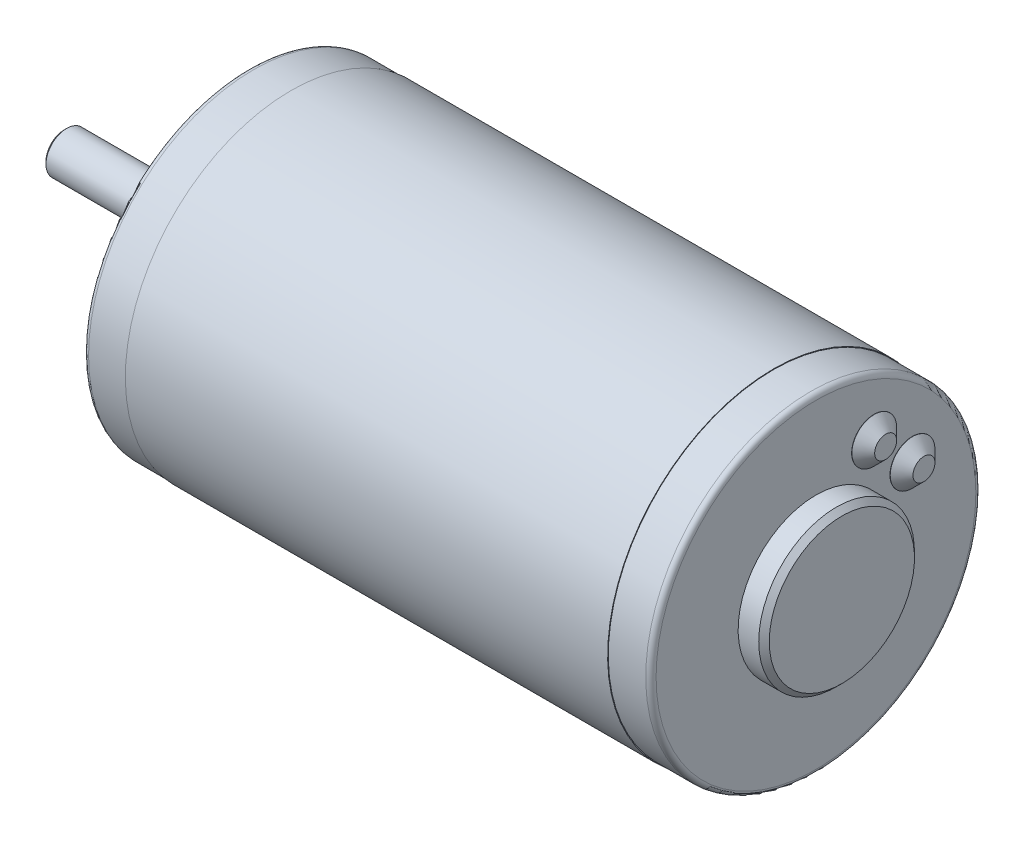
ISO-10303-21;
HEADER;
FILE_DESCRIPTION(('STEP AP214'),'2;1');
FILE_NAME('part.step','',(''),(''),'','','');
FILE_SCHEMA(('AUTOMOTIVE_DESIGN { 1 0 10303 214 1 1 1 1 }'));
ENDSEC;
DATA;
#1=APPLICATION_CONTEXT('core data for automotive mechanical design processes');
#2=APPLICATION_PROTOCOL_DEFINITION('international standard','automotive_design',2000,#1);
#3=PRODUCT_CONTEXT('',#1,'mechanical');
#4=PRODUCT('Part','Part','',(#3));
#5=PRODUCT_RELATED_PRODUCT_CATEGORY('part','',(#4));
#6=PRODUCT_DEFINITION_FORMATION('','',#4);
#7=PRODUCT_DEFINITION_CONTEXT('part definition',#1,'design');
#8=PRODUCT_DEFINITION('design','',#6,#7);
#9=PRODUCT_DEFINITION_SHAPE('','',#8);
#10=(LENGTH_UNIT() NAMED_UNIT(*) SI_UNIT(.MILLI.,.METRE.));
#11=(NAMED_UNIT(*) PLANE_ANGLE_UNIT() SI_UNIT($,.RADIAN.));
#12=(NAMED_UNIT(*) SI_UNIT($,.STERADIAN.) SOLID_ANGLE_UNIT());
#13=UNCERTAINTY_MEASURE_WITH_UNIT(LENGTH_MEASURE(1.E-05),#10,'distance_accuracy_value','');
#14=(GEOMETRIC_REPRESENTATION_CONTEXT(3) GLOBAL_UNCERTAINTY_ASSIGNED_CONTEXT((#13)) GLOBAL_UNIT_ASSIGNED_CONTEXT((#10,
#11,#12)) REPRESENTATION_CONTEXT('',''));
#15=CARTESIAN_POINT('',(0.,0.,0.));
#16=DIRECTION('',(0.,0.,1.));
#17=DIRECTION('',(1.,0.,0.));
#18=AXIS2_PLACEMENT_3D('',#15,#16,#17);
#19=CARTESIAN_POINT('',(-35.6000000000001,1.73472347597681E-13,-2.77555756156289E-13));
#20=DIRECTION('',(-1.,0.,0.));
#21=DIRECTION('',(0.,0.,1.));
#22=AXIS2_PLACEMENT_3D('',#19,#20,#21);
#23=PLANE('',#22);
#24=CARTESIAN_POINT('',(-35.6000000000449,-1.04083408558612E-13,-2.35922392732846E-13));
#25=DIRECTION('',(1.,0.,0.));
#26=DIRECTION('',(0.,0.,-1.));
#27=AXIS2_PLACEMENT_3D('',#24,#25,#26);
#28=CIRCLE('',#27,3.50000000003069);
#29=CARTESIAN_POINT('',(-35.6000000000449,-1.04083408558612E-13,-3.50000000003092));
#30=VERTEX_POINT('',#29);
#31=EDGE_CURVE('E86',#30,#30,#28,.T.);
#32=ORIENTED_EDGE('',*,*,#31,.F.);
#33=EDGE_LOOP('',(#32));
#34=FACE_BOUND('',#33,.T.);
#35=ADVANCED_FACE('F17',(#34),#23,.T.);
#36=CARTESIAN_POINT('',(-27.6,-0.999999999999773,-2.79999999999991));
#37=DIRECTION('',(0.,0.,1.));
#38=DIRECTION('',(0.,-1.,0.));
#39=AXIS2_PLACEMENT_3D('',#36,#37,#38);
#40=PLANE('',#39);
#41=CARTESIAN_POINT('',(-7.09999999999983,0.,-2.80000000000004));
#42=DIRECTION('',(0.,0.,-1.));
#43=DIRECTION('',(0.,1.,0.));
#44=AXIS2_PLACEMENT_3D('',#41,#42,#43);
#45=CIRCLE('',#44,1.);
#46=CARTESIAN_POINT('',(-7.09999999999997,1.00000000000033,-2.8));
#47=VERTEX_POINT('',#46);
#48=CARTESIAN_POINT('',(-7.10000000000005,-0.999999999999912,-2.80000000000004));
#49=VERTEX_POINT('',#48);
#50=EDGE_CURVE('E352',#47,#49,#45,.T.);
#51=ORIENTED_EDGE('',*,*,#50,.T.);
#52=DIRECTION('',(1.,0.,0.));
#53=VECTOR('',#52,1.);
#54=CARTESIAN_POINT('',(-27.6,-0.999999999999773,-2.80000000000001));
#55=LINE('',#54,#53);
#56=CARTESIAN_POINT('',(-26.5999999999999,-0.999999999999773,-2.80000000000001));
#57=VERTEX_POINT('',#56);
#58=EDGE_CURVE('E75',#57,#49,#55,.T.);
#59=ORIENTED_EDGE('',*,*,#58,.F.);
#60=CARTESIAN_POINT('',(-26.6,-1.03988108337105E-13,-2.80000000000001));
#61=DIRECTION('',(0.,0.,1.));
#62=DIRECTION('',(0.,-1.,0.));
#63=AXIS2_PLACEMENT_3D('',#60,#61,#62);
#64=CIRCLE('',#63,1.);
#65=CARTESIAN_POINT('',(-26.5999999999999,1.00000000000012,-2.80000000000001));
#66=VERTEX_POINT('',#65);
#67=EDGE_CURVE('E77',#57,#66,#64,.F.);
#68=ORIENTED_EDGE('',*,*,#67,.T.);
#69=DIRECTION('',(1.,0.,0.));
#70=VECTOR('',#69,1.);
#71=CARTESIAN_POINT('',(-27.5999999999998,1.00000000000033,-2.79999999999996));
#72=LINE('',#71,#70);
#73=EDGE_CURVE('E80',#66,#47,#72,.T.);
#74=ORIENTED_EDGE('',*,*,#73,.T.);
#75=EDGE_LOOP('',(#51,#59,#68,#74));
#76=FACE_BOUND('',#75,.T.);
#77=ADVANCED_FACE('F79',(#76),#40,.F.);
#78=CARTESIAN_POINT('',(-27.5999999999998,1.00000000000033,-2.80000000000007));
#79=DIRECTION('',(0.,1.,0.));
#80=DIRECTION('',(0.,0.,1.));
#81=AXIS2_PLACEMENT_3D('',#78,#79,#80);
#82=PLANE('',#81);
#83=DIRECTION('',(0.,0.,1.));
#84=VECTOR('',#83,1.);
#85=CARTESIAN_POINT('',(-7.10000000000011,1.00000000000033,-2.80000000000007));
#86=LINE('',#85,#84);
#87=CARTESIAN_POINT('',(-7.09999999999997,1.00000000000045,-3.87298334620729));
#88=VERTEX_POINT('',#87);
#89=EDGE_CURVE('E94',#88,#47,#86,.T.);
#90=ORIENTED_EDGE('',*,*,#89,.T.);
#91=ORIENTED_EDGE('',*,*,#73,.F.);
#92=DIRECTION('',(0.,0.,1.));
#93=VECTOR('',#92,1.);
#94=CARTESIAN_POINT('',(-26.5999999999997,0.999999999999896,-3.87298334620738));
#95=LINE('',#94,#93);
#96=CARTESIAN_POINT('',(-26.5999999999999,1.00000000000006,-3.87298334620735));
#97=VERTEX_POINT('',#96);
#98=EDGE_CURVE('E85',#66,#97,#95,.F.);
#99=ORIENTED_EDGE('',*,*,#98,.T.);
#100=DIRECTION('',(1.,0.,0.));
#101=VECTOR('',#100,1.);
#102=CARTESIAN_POINT('',(0.,1.00000000000057,-3.87298334620726));
#103=LINE('',#102,#101);
#104=EDGE_CURVE('E109',#88,#97,#103,.F.);
#105=ORIENTED_EDGE('',*,*,#104,.F.);
#106=EDGE_LOOP('',(#90,#91,#99,#105));
#107=FACE_BOUND('',#106,.T.);
#108=ADVANCED_FACE('F90',(#107),#82,.F.);
#109=CARTESIAN_POINT('',(-35.1000000000568,-1.04083408558612E-13,-2.35922392732846E-13));
#110=DIRECTION('',(1.,0.,0.));
#111=DIRECTION('',(0.,0.,-1.));
#112=AXIS2_PLACEMENT_3D('',#109,#110,#111);
#113=CONICAL_SURFACE('',#112,4.00000000001886,0.785398163397448);
#114=ORIENTED_EDGE('',*,*,#31,.T.);
#115=EDGE_LOOP('',(#114));
#116=FACE_BOUND('',#115,.T.);
#117=CARTESIAN_POINT('',(-35.1000000000003,0.,0.));
#118=DIRECTION('',(1.,0.,0.));
#119=DIRECTION('',(0.,1.,0.));
#120=AXIS2_PLACEMENT_3D('',#117,#118,#119);
#121=CIRCLE('',#120,3.99999999999999);
#122=CARTESIAN_POINT('',(-35.1000000000003,3.99999999999999,0.));
#123=VERTEX_POINT('',#122);
#124=EDGE_CURVE('E107',#123,#123,#121,.T.);
#125=ORIENTED_EDGE('',*,*,#124,.F.);
#126=EDGE_LOOP('',(#125));
#127=FACE_BOUND('',#126,.T.);
#128=ADVANCED_FACE('F362',(#116,#127),#113,.T.);
#129=CARTESIAN_POINT('',(-26.6,-1.04517089427603E-13,-3.87298334620738));
#130=DIRECTION('',(0.,0.,1.));
#131=DIRECTION('',(0.,-1.,0.));
#132=AXIS2_PLACEMENT_3D('',#129,#130,#131);
#133=CYLINDRICAL_SURFACE('',#132,1.);
#134=CARTESIAN_POINT('',(-26.6,0.999999999999896,-3.87298334620744));
#135=CARTESIAN_POINT('',(-26.6276629618862,1.00000033683272,-3.87298148578631));
#136=CARTESIAN_POINT('',(-26.6553122166169,0.998851408973414,-3.87328009898516));
#137=CARTESIAN_POINT('',(-26.7104039432582,0.994271305308465,-3.874459045294));
#138=CARTESIAN_POINT('',(-26.7378464491771,0.99084051352083,-3.87533928052186));
#139=CARTESIAN_POINT('',(-26.8194530833432,0.977175260843312,-3.87881710393728));
#140=CARTESIAN_POINT('',(-26.8730564246123,0.963567703685188,-3.88225202757009));
#141=CARTESIAN_POINT('',(-26.977125593587,0.9277977666641,-3.89095430304384));
#142=CARTESIAN_POINT('',(-27.0275916629556,0.905636046675176,-3.89622151353782));
#143=CARTESIAN_POINT('',(-27.1241130864299,0.853414285078966,-3.90799157486741));
#144=CARTESIAN_POINT('',(-27.1701674100592,0.823352404294419,-3.91449471333244));
#145=CARTESIAN_POINT('',(-27.2575394864379,0.755487979247824,-3.92816193945041));
#146=CARTESIAN_POINT('',(-27.2987466452782,0.71754520146856,-3.93533648748832));
#147=CARTESIAN_POINT('',(-27.374295287631,0.635284227526676,-3.94944965646413));
#148=CARTESIAN_POINT('',(-27.4086343067441,0.590963752716439,-3.95638819197843));
#149=CARTESIAN_POINT('',(-27.4699263913366,0.496434353262319,-3.96936513280701));
#150=CARTESIAN_POINT('',(-27.4967663594361,0.446150035120147,-3.97538918749289));
#151=CARTESIAN_POINT('',(-27.5415435234846,0.34164231638429,-3.98572777190496));
#152=CARTESIAN_POINT('',(-27.5594913901323,0.287423727052179,-3.99004434937703));
#153=CARTESIAN_POINT('',(-27.5817561327114,0.194111735626768,-3.99546891720265));
#154=CARTESIAN_POINT('',(-27.5885857933547,0.15563291802012,-3.99715927898668));
#155=CARTESIAN_POINT('',(-27.5977085408135,0.0781080027780594,-3.99942531582645));
#156=CARTESIAN_POINT('',(-27.6000016937716,0.0390619134218824,-4.00000100713419));
#157=CARTESIAN_POINT('',(-27.599997605085,-0.0552317459833981,-3.99999857595864));
#158=CARTESIAN_POINT('',(-27.5954072017814,-0.110495128478842,-3.99884417849431));
#159=CARTESIAN_POINT('',(-27.5771887284744,-0.219452299234425,-3.99434884496973));
#160=CARTESIAN_POINT('',(-27.5635520456883,-0.273144540728266,-3.99100582520555));
#161=CARTESIAN_POINT('',(-27.5277065776785,-0.377348216031208,-3.98250401525138));
#162=CARTESIAN_POINT('',(-27.50550949133,-0.427863881926167,-3.97734770399772));
#163=CARTESIAN_POINT('',(-27.4532106110737,-0.524450982676889,-3.96576858613918));
#164=CARTESIAN_POINT('',(-27.423109018223,-0.570522530531439,-3.95934581174879));
#165=CARTESIAN_POINT('',(-27.3552003629654,-0.657866871057299,-3.9457829173005));
#166=CARTESIAN_POINT('',(-27.3172610821917,-0.699035148909396,-3.93863172676561));
#167=CARTESIAN_POINT('',(-27.2350335448417,-0.774497762760093,-3.92449111086286));
#168=CARTESIAN_POINT('',(-27.1907442793301,-0.808791004318464,-3.91750171140699));
#169=CARTESIAN_POINT('',(-27.0962571540368,-0.870026617564701,-3.90436326544459));
#170=CARTESIAN_POINT('',(-27.0459800204074,-0.896849892050615,-3.8982285370107));
#171=CARTESIAN_POINT('',(-26.9414633719416,-0.941609493202719,-3.88766043493566));
#172=CARTESIAN_POINT('',(-26.8872268673447,-0.959552492279237,-3.88322578446615));
#173=CARTESIAN_POINT('',(-26.7939162001484,-0.981793057388644,-3.87765011739133));
#174=CARTESIAN_POINT('',(-26.7554596460299,-0.988610024877078,-3.87591131774121));
#175=CARTESIAN_POINT('',(-26.6780089785749,-0.997716332082892,-3.87357302813834));
#176=CARTESIAN_POINT('',(-26.6390152728011,-1.0000089326104,-3.87297271766373));
#177=CARTESIAN_POINT('',(-26.5999999999999,-1.00000000000011,-3.87298334620738));
#178=B_SPLINE_CURVE_WITH_KNOTS('',3,(#134,#135,#136,#137,#138,#139,#140,#141,#142,#143,#144,
#145,#146,#147,#148,#149,#150,#151,#152,#153,#154,#155,#156,#157,#158,#159,#160,#161,#162,#163,
#164,#165,#166,#167,#168,#169,#170,#171,#172,#173,#174,#175,#176,#177),.UNSPECIFIED.,.F.,.F.,(4,
2,2,2,2,2,2,2,2,2,2,2,2,2,2,2,2,2,2,2,2,4),(0.,0.0829364608197416,0.165858967679138,
0.331229962709977,0.496588203456516,0.66198497417125,0.830625162094533,0.999325752711568,
1.17044795789403,1.34136431261154,1.45844938979963,1.57553275986401,1.74108325106581,
1.9067915862413,2.07227425793979,2.23775272086773,2.4062917684524,2.57485762457931,
2.74597444954031,2.91696250578406,3.03398040676348,3.15091393953954),.UNSPECIFIED.);
#179=CARTESIAN_POINT('',(-26.5999999999999,-0.999999999999796,-3.87298334620746));
#180=VERTEX_POINT('',#179);
#181=EDGE_CURVE('E99',#97,#180,#178,.T.);
#182=ORIENTED_EDGE('',*,*,#181,.F.);
#183=ORIENTED_EDGE('',*,*,#98,.F.);
#184=ORIENTED_EDGE('',*,*,#67,.F.);
#185=DIRECTION('',(0.,0.,1.));
#186=VECTOR('',#185,1.);
#187=CARTESIAN_POINT('',(-26.5999999999998,-0.999999999999773,-2.79999999999991));
#188=LINE('',#187,#186);
#189=EDGE_CURVE('E101',#180,#57,#188,.T.);
#190=ORIENTED_EDGE('',*,*,#189,.F.);
#191=EDGE_LOOP('',(#182,#183,#184,#190));
#192=FACE_BOUND('',#191,.T.);
#193=ADVANCED_FACE('F97',(#192),#133,.F.);
#194=CARTESIAN_POINT('',(-27.6,-0.999999999999773,-2.79999999999991));
#195=DIRECTION('',(0.,1.,0.));
#196=DIRECTION('',(0.,0.,1.));
#197=AXIS2_PLACEMENT_3D('',#194,#195,#196);
#198=PLANE('',#197);
#199=DIRECTION('',(1.,0.,0.));
#200=VECTOR('',#199,1.);
#201=CARTESIAN_POINT('',(0.,-0.999999999999817,-3.87298334620746));
#202=LINE('',#201,#200);
#203=CARTESIAN_POINT('',(-7.10000000000022,-0.999999999999993,-3.87298334620743));
#204=VERTEX_POINT('',#203);
#205=EDGE_CURVE('E163',#180,#204,#202,.T.);
#206=ORIENTED_EDGE('',*,*,#205,.F.);
#207=ORIENTED_EDGE('',*,*,#189,.T.);
#208=ORIENTED_EDGE('',*,*,#58,.T.);
#209=DIRECTION('',(0.,0.,-1.));
#210=VECTOR('',#209,1.);
#211=CARTESIAN_POINT('',(-7.10000000000027,-1.00000000000005,-2.8));
#212=LINE('',#211,#210);
#213=EDGE_CURVE('E105',#49,#204,#212,.T.);
#214=ORIENTED_EDGE('',*,*,#213,.T.);
#215=EDGE_LOOP('',(#206,#207,#208,#214));
#216=FACE_BOUND('',#215,.T.);
#217=ADVANCED_FACE('F550',(#216),#198,.T.);
#218=CARTESIAN_POINT('',(-7.09999999999983,0.,-2.8));
#219=DIRECTION('',(0.,0.,-1.));
#220=DIRECTION('',(0.,1.,0.));
#221=AXIS2_PLACEMENT_3D('',#218,#219,#220);
#222=CYLINDRICAL_SURFACE('',#221,1.);
#223=ORIENTED_EDGE('',*,*,#50,.F.);
#224=ORIENTED_EDGE('',*,*,#89,.F.);
#225=CARTESIAN_POINT('',(-7.10000000000016,-1.00000000000005,-3.8729833462074));
#226=CARTESIAN_POINT('',(-7.072337038114,-1.00000033683288,-3.87298148578626));
#227=CARTESIAN_POINT('',(-7.04468778338332,-0.998851408973587,-3.87328009898511));
#228=CARTESIAN_POINT('',(-6.98959605674198,-0.994271305308656,-3.87445904529395));
#229=CARTESIAN_POINT('',(-6.96215355082305,-0.99084051352103,-3.87533928052181));
#230=CARTESIAN_POINT('',(-6.88054691665694,-0.977175260843541,-3.87881710393723));
#231=CARTESIAN_POINT('',(-6.8269435753879,-0.963567703685435,-3.88225202757002));
#232=CARTESIAN_POINT('',(-6.72287440641311,-0.927797766664384,-3.89095430304377));
#233=CARTESIAN_POINT('',(-6.6724083370446,-0.905636046675479,-3.89622151353775));
#234=CARTESIAN_POINT('',(-6.57588691357024,-0.853414285079304,-3.90799157486733));
#235=CARTESIAN_POINT('',(-6.52983258994098,-0.823352404294773,-3.91449471333236));
#236=CARTESIAN_POINT('',(-6.44246051356226,-0.75548797924821,-3.92816193945033));
#237=CARTESIAN_POINT('',(-6.40125335472195,-0.717545201468963,-3.93533648748825));
#238=CARTESIAN_POINT('',(-6.32570471236904,-0.635284227527108,-3.94944965646406));
#239=CARTESIAN_POINT('',(-6.29136569325591,-0.590963752716884,-3.95638819197836));
#240=CARTESIAN_POINT('',(-6.23007360866342,-0.496434353262786,-3.96936513280695));
#241=CARTESIAN_POINT('',(-6.20323364056388,-0.446150035120625,-3.97538918749283));
#242=CARTESIAN_POINT('',(-6.15845647651535,-0.341642316384785,-3.98572777190491));
#243=CARTESIAN_POINT('',(-6.14050860986763,-0.28742372705268,-3.990044349377));
#244=CARTESIAN_POINT('',(-6.11824386728853,-0.194111735627195,-3.99546891720263));
#245=CARTESIAN_POINT('',(-6.11141420664517,-0.155632918020465,-3.99715927898667));
#246=CARTESIAN_POINT('',(-6.10229145918636,-0.0781080027782378,-3.99942531582645));
#247=CARTESIAN_POINT('',(-6.09999830622821,-0.0390619134219762,-4.00000100713419));
#248=CARTESIAN_POINT('',(-6.10000239491486,0.0552317459833889,-3.99999857595864));
#249=CARTESIAN_POINT('',(-6.10459279821841,0.110495128478832,-3.99884417849431));
#250=CARTESIAN_POINT('',(-6.12281127152547,0.219452299234413,-3.99434884496973));
#251=CARTESIAN_POINT('',(-6.13644795431156,0.273144540728252,-3.99100582520555));
#252=CARTESIAN_POINT('',(-6.17229342232141,0.37734821603119,-3.98250401525138));
#253=CARTESIAN_POINT('',(-6.19449050866989,0.427863881926146,-3.97734770399773));
#254=CARTESIAN_POINT('',(-6.24678938892622,0.524450982676861,-3.96576858613919));
#255=CARTESIAN_POINT('',(-6.2768909817769,0.570522530531407,-3.95934581174879));
#256=CARTESIAN_POINT('',(-6.3447996370345,0.657866871057259,-3.94578291730051));
#257=CARTESIAN_POINT('',(-6.38273891780822,0.699035148909351,-3.93863172676562));
#258=CARTESIAN_POINT('',(-6.46496645515824,0.774497762760036,-3.92449111086287));
#259=CARTESIAN_POINT('',(-6.50925572066989,0.808791004318401,-3.917501711407));
#260=CARTESIAN_POINT('',(-6.60374284596318,0.870026617564623,-3.90436326544461));
#261=CARTESIAN_POINT('',(-6.65401997959254,0.89684989205053,-3.89822853701072));
#262=CARTESIAN_POINT('',(-6.75853662805843,0.941609493202617,-3.88766043493568));
#263=CARTESIAN_POINT('',(-6.81277313265532,0.959552492279126,-3.88322578446618));
#264=CARTESIAN_POINT('',(-6.90608379985158,0.98179305738851,-3.87765011739136));
#265=CARTESIAN_POINT('',(-6.94454035396997,0.988610024876933,-3.87591131774125));
#266=CARTESIAN_POINT('',(-7.02199102142495,0.997716332082737,-3.87357302813837));
#267=CARTESIAN_POINT('',(-7.06098472719867,1.00000893261024,-3.87297271766377));
#268=CARTESIAN_POINT('',(-7.09999999999986,0.999999999999951,-3.87298334620742));
#269=B_SPLINE_CURVE_WITH_KNOTS('',3,(#225,#226,#227,#228,#229,#230,#231,#232,#233,#234,#235,
#236,#237,#238,#239,#240,#241,#242,#243,#244,#245,#246,#247,#248,#249,#250,#251,#252,#253,#254,
#255,#256,#257,#258,#259,#260,#261,#262,#263,#264,#265,#266,#267,#268),.UNSPECIFIED.,.F.,.F.,(4,
2,2,2,2,2,2,2,2,2,2,2,2,2,2,2,2,2,2,2,2,4),(0.,0.0829364608197386,0.165858967679133,
0.331229962709968,0.496588203456498,0.661984974171228,0.830625162094508,0.99932575271154,
1.170447957894,1.34136431261151,1.45844938979986,1.57553275986449,1.74108325106629,
1.90679158624178,2.07227425794027,2.23775272086822,2.40629176845289,2.5748576245798,
2.7459744495408,2.91696250578455,3.03398040676384,3.15091393953981),.UNSPECIFIED.);
#270=EDGE_CURVE('E156',#204,#88,#269,.T.);
#271=ORIENTED_EDGE('',*,*,#270,.F.);
#272=ORIENTED_EDGE('',*,*,#213,.F.);
#273=EDGE_LOOP('',(#223,#224,#271,#272));
#274=FACE_BOUND('',#273,.T.);
#275=ADVANCED_FACE('F169',(#274),#222,.F.);
#276=CARTESIAN_POINT('',(0.,0.,0.));
#277=DIRECTION('',(1.,0.,0.));
#278=DIRECTION('',(0.,1.,0.));
#279=AXIS2_PLACEMENT_3D('',#276,#277,#278);
#280=CYLINDRICAL_SURFACE('',#279,3.99999999999999);
#281=ORIENTED_EDGE('',*,*,#124,.T.);
#282=EDGE_LOOP('',(#281));
#283=FACE_BOUND('',#282,.T.);
#284=ORIENTED_EDGE('',*,*,#104,.T.);
#285=ORIENTED_EDGE('',*,*,#181,.T.);
#286=ORIENTED_EDGE('',*,*,#205,.T.);
#287=ORIENTED_EDGE('',*,*,#270,.T.);
#288=EDGE_LOOP('',(#284,#285,#286,#287));
#289=FACE_BOUND('',#288,.T.);
#290=CARTESIAN_POINT('',(-4.00000000000022,0.,0.));
#291=DIRECTION('',(1.,0.,0.));
#292=DIRECTION('',(0.,1.,0.));
#293=AXIS2_PLACEMENT_3D('',#290,#291,#292);
#294=CIRCLE('',#293,3.99999999999999);
#295=CARTESIAN_POINT('',(-4.00000000000022,3.99999999999999,0.));
#296=VERTEX_POINT('',#295);
#297=EDGE_CURVE('E153',#296,#296,#294,.T.);
#298=ORIENTED_EDGE('',*,*,#297,.F.);
#299=EDGE_LOOP('',(#298));
#300=FACE_BOUND('',#299,.T.);
#301=ADVANCED_FACE('F172',(#283,#289,#300),#280,.T.);
#302=CARTESIAN_POINT('',(-4.00000000000011,4.00000000000001,-1.2490009027033E-13));
#303=DIRECTION('',(-1.,0.,0.));
#304=DIRECTION('',(0.,0.,1.));
#305=AXIS2_PLACEMENT_3D('',#302,#303,#304);
#306=PLANE('',#305);
#307=ORIENTED_EDGE('',*,*,#297,.T.);
#308=EDGE_LOOP('',(#307));
#309=FACE_BOUND('',#308,.T.);
#310=CARTESIAN_POINT('',(-4.00000000000009,1.66487194401081E-13,0.));
#311=DIRECTION('',(1.,0.,0.));
#312=DIRECTION('',(0.,1.,0.));
#313=AXIS2_PLACEMENT_3D('',#310,#311,#312);
#314=CIRCLE('',#313,8.50899999999978);
#315=CARTESIAN_POINT('',(-4.00000000000009,8.50899999999995,0.));
#316=VERTEX_POINT('',#315);
#317=EDGE_CURVE('E150',#316,#316,#314,.T.);
#318=ORIENTED_EDGE('',*,*,#317,.F.);
#319=EDGE_LOOP('',(#318));
#320=FACE_BOUND('',#319,.T.);
#321=ADVANCED_FACE('F176',(#309,#320),#306,.T.);
#322=CARTESIAN_POINT('',(111.8479,18.6070906828551,-11.2073596390946));
#323=DIRECTION('',(1.,0.,0.));
#324=DIRECTION('',(0.,0.,-1.));
#325=AXIS2_PLACEMENT_3D('',#322,#323,#324);
#326=PLANE('',#325);
#327=CARTESIAN_POINT('',(111.84789999993,18.6070906828551,-11.2073596390946));
#328=DIRECTION('',(-1.,0.,0.));
#329=DIRECTION('',(0.,-1.,0.));
#330=AXIS2_PLACEMENT_3D('',#327,#328,#329);
#331=CIRCLE('',#330,2.11800000003175);
#332=CARTESIAN_POINT('',(111.84789999993,16.4890906828234,-11.2073596390946));
#333=VERTEX_POINT('',#332);
#334=EDGE_CURVE('E147',#333,#333,#331,.T.);
#335=ORIENTED_EDGE('',*,*,#334,.F.);
#336=EDGE_LOOP('',(#335));
#337=FACE_BOUND('',#336,.T.);
#338=ADVANCED_FACE('F181',(#337),#326,.T.);
#339=CARTESIAN_POINT('',(114.6,15.0368000000001,-2.63677968348475E-13));
#340=DIRECTION('',(1.,0.,0.));
#341=DIRECTION('',(0.,0.,-1.));
#342=AXIS2_PLACEMENT_3D('',#339,#340,#341);
#343=PLANE('',#342);
#344=CARTESIAN_POINT('',(114.6,2.91377144650731E-13,0.));
#345=DIRECTION('',(-1.,0.,0.));
#346=DIRECTION('',(0.,0.,1.));
#347=AXIS2_PLACEMENT_3D('',#344,#345,#346);
#348=CIRCLE('',#347,14.0208);
#349=CARTESIAN_POINT('',(114.6,2.91377144650731E-13,14.0207999999999));
#350=VERTEX_POINT('',#349);
#351=EDGE_CURVE('E144',#350,#350,#348,.T.);
#352=ORIENTED_EDGE('',*,*,#351,.F.);
#353=EDGE_LOOP('',(#352));
#354=FACE_BOUND('',#353,.T.);
#355=ADVANCED_FACE('F185',(#354),#343,.T.);
#356=CARTESIAN_POINT('',(111.8479,11.2073596390942,-18.6070906828554));
#357=DIRECTION('',(1.,0.,0.));
#358=DIRECTION('',(0.,0.,-1.));
#359=AXIS2_PLACEMENT_3D('',#356,#357,#358);
#360=PLANE('',#359);
#361=CARTESIAN_POINT('',(111.84789999993,11.2073596390942,-18.6070906828554));
#362=DIRECTION('',(-1.,0.,0.));
#363=DIRECTION('',(0.,0.,1.));
#364=AXIS2_PLACEMENT_3D('',#361,#362,#363);
#365=CIRCLE('',#364,2.11800000000219);
#366=CARTESIAN_POINT('',(111.84789999993,11.2073596390942,-16.4890906828532));
#367=VERTEX_POINT('',#366);
#368=EDGE_CURVE('E140',#367,#367,#365,.T.);
#369=ORIENTED_EDGE('',*,*,#368,.F.);
#370=EDGE_LOOP('',(#369));
#371=FACE_BOUND('',#370,.T.);
#372=ADVANCED_FACE('F189',(#371),#360,.T.);
#373=CARTESIAN_POINT('',(13.6144000000513,25.4000000000002,-3.60822483003176E-13));
#374=DIRECTION('',(-1.,0.,0.));
#375=DIRECTION('',(0.,-1.,0.));
#376=AXIS2_PLACEMENT_3D('',#373,#374,#375);
#377=CONICAL_SURFACE('',#376,2.01929999985886,1.02974425857689);
#378=CARTESIAN_POINT('',(14.8277178480214,25.4000000000002,5.64825974301894E-11));
#379=VERTEX_POINT('',#378);
#380=VERTEX_LOOP('',#379);
#381=FACE_BOUND('',#380,.T.);
#382=CARTESIAN_POINT('',(13.6144000000001,25.4,-2.08155008518183E-13));
#383=DIRECTION('',(-1.,0.,0.));
#384=DIRECTION('',(0.,-1.,0.));
#385=AXIS2_PLACEMENT_3D('',#382,#383,#384);
#386=CIRCLE('',#385,2.0193);
#387=CARTESIAN_POINT('',(13.6144000000001,23.3807,-2.08155008518183E-13));
#388=VERTEX_POINT('',#387);
#389=EDGE_CURVE('E143',#388,#388,#386,.T.);
#390=ORIENTED_EDGE('',*,*,#389,.T.);
#391=EDGE_LOOP('',(#390));
#392=FACE_BOUND('',#391,.T.);
#393=ADVANCED_FACE('F193',(#381,#392),#377,.F.);
#394=CARTESIAN_POINT('',(13.6144000000513,-25.3999999999997,0.));
#395=DIRECTION('',(-1.,0.,0.));
#396=DIRECTION('',(0.,-1.,0.));
#397=AXIS2_PLACEMENT_3D('',#394,#395,#396);
#398=CONICAL_SURFACE('',#397,2.01929999985854,1.02974425857674);
#399=CARTESIAN_POINT('',(14.8277178480214,-25.3999999999997,5.6808725443673E-11));
#400=VERTEX_POINT('',#399);
#401=VERTEX_LOOP('',#400);
#402=FACE_BOUND('',#401,.T.);
#403=CARTESIAN_POINT('',(13.6143999999999,-25.3999999999997,0.));
#404=DIRECTION('',(-1.,0.,0.));
#405=DIRECTION('',(0.,-1.,0.));
#406=AXIS2_PLACEMENT_3D('',#403,#404,#405);
#407=CIRCLE('',#406,2.0193);
#408=CARTESIAN_POINT('',(13.6143999999999,-27.4192999999997,0.));
#409=VERTEX_POINT('',#408);
#410=EDGE_CURVE('E342',#409,#409,#407,.T.);
#411=ORIENTED_EDGE('',*,*,#410,.T.);
#412=EDGE_LOOP('',(#411));
#413=FACE_BOUND('',#412,.T.);
#414=ADVANCED_FACE('F197',(#402,#413),#398,.F.);
#415=CARTESIAN_POINT('',(-2.98399999999987,1.66533453693773E-13,0.));
#416=DIRECTION('',(1.,0.,0.));
#417=DIRECTION('',(0.,1.,0.));
#418=AXIS2_PLACEMENT_3D('',#415,#416,#417);
#419=CONICAL_SURFACE('',#418,9.525,0.78539816339745);
#420=ORIENTED_EDGE('',*,*,#317,.T.);
#421=EDGE_LOOP('',(#420));
#422=FACE_BOUND('',#421,.T.);
#423=CARTESIAN_POINT('',(-2.98399999999988,0.,0.));
#424=DIRECTION('',(1.,0.,0.));
#425=DIRECTION('',(0.,1.,0.));
#426=AXIS2_PLACEMENT_3D('',#423,#424,#425);
#427=CIRCLE('',#426,9.525);
#428=CARTESIAN_POINT('',(-2.98399999999988,9.525,0.));
#429=VERTEX_POINT('',#428);
#430=EDGE_CURVE('E337',#429,#429,#427,.T.);
#431=ORIENTED_EDGE('',*,*,#430,.F.);
#432=EDGE_LOOP('',(#431));
#433=FACE_BOUND('',#432,.T.);
#434=ADVANCED_FACE('F201',(#422,#433),#419,.T.);
#435=CARTESIAN_POINT('',(109.647900000027,18.6070906828551,-11.2073596390946));
#436=DIRECTION('',(-1.,0.,0.));
#437=DIRECTION('',(0.,-1.,0.));
#438=AXIS2_PLACEMENT_3D('',#435,#436,#437);
#439=CONICAL_SURFACE('',#438,4.31799999987741,0.785398163384529);
#440=CARTESIAN_POINT('',(109.6479,18.6070906828551,-11.2073596390946));
#441=DIRECTION('',(-1.,0.,0.));
#442=DIRECTION('',(0.,-1.,0.));
#443=AXIS2_PLACEMENT_3D('',#440,#441,#442);
#444=CIRCLE('',#443,4.318);
#445=CARTESIAN_POINT('',(109.6479,14.2890906828551,-11.2073596390946));
#446=VERTEX_POINT('',#445);
#447=EDGE_CURVE('E335',#446,#446,#444,.T.);
#448=ORIENTED_EDGE('',*,*,#447,.F.);
#449=EDGE_LOOP('',(#448));
#450=FACE_BOUND('',#449,.T.);
#451=ORIENTED_EDGE('',*,*,#334,.T.);
#452=EDGE_LOOP('',(#451));
#453=FACE_BOUND('',#452,.T.);
#454=ADVANCED_FACE('F205',(#450,#453),#439,.T.);
#455=CARTESIAN_POINT('',(113.584,2.91377144650731E-13,0.));
#456=DIRECTION('',(-1.,0.,0.));
#457=DIRECTION('',(0.,0.,1.));
#458=AXIS2_PLACEMENT_3D('',#455,#456,#457);
#459=CONICAL_SURFACE('',#458,15.0368000000001,0.78539816339744);
#460=ORIENTED_EDGE('',*,*,#351,.T.);
#461=EDGE_LOOP('',(#460));
#462=FACE_BOUND('',#461,.T.);
#463=CARTESIAN_POINT('',(113.584,0.,0.));
#464=DIRECTION('',(1.,0.,0.));
#465=DIRECTION('',(0.,1.,0.));
#466=AXIS2_PLACEMENT_3D('',#463,#464,#465);
#467=CIRCLE('',#466,15.0368);
#468=CARTESIAN_POINT('',(113.584,15.0368,0.));
#469=VERTEX_POINT('',#468);
#470=EDGE_CURVE('E336',#469,#469,#467,.F.);
#471=ORIENTED_EDGE('',*,*,#470,.F.);
#472=EDGE_LOOP('',(#471));
#473=FACE_BOUND('',#472,.T.);
#474=ADVANCED_FACE('F209',(#462,#473),#459,.T.);
#475=CARTESIAN_POINT('',(109.647900000084,11.2073596390942,-18.6070906828554));
#476=DIRECTION('',(-1.,0.,0.));
#477=DIRECTION('',(0.,0.,1.));
#478=AXIS2_PLACEMENT_3D('',#475,#476,#477);
#479=CONICAL_SURFACE('',#478,4.3179999999047,0.785398163410367);
#480=CARTESIAN_POINT('',(109.6479,11.2073596390942,-18.6070906828554));
#481=DIRECTION('',(-1.,0.,0.));
#482=DIRECTION('',(0.,-1.,0.));
#483=AXIS2_PLACEMENT_3D('',#480,#481,#482);
#484=CIRCLE('',#483,4.318);
#485=CARTESIAN_POINT('',(109.6479,6.88935963909421,-18.6070906828554));
#486=VERTEX_POINT('',#485);
#487=EDGE_CURVE('E139',#486,#486,#484,.T.);
#488=ORIENTED_EDGE('',*,*,#487,.F.);
#489=EDGE_LOOP('',(#488));
#490=FACE_BOUND('',#489,.T.);
#491=ORIENTED_EDGE('',*,*,#368,.T.);
#492=EDGE_LOOP('',(#491));
#493=FACE_BOUND('',#492,.T.);
#494=ADVANCED_FACE('F213',(#490,#493),#479,.T.);
#495=CARTESIAN_POINT('',(-1.66099772824779E-13,25.4,-2.08166817117217E-13));
#496=DIRECTION('',(-1.,0.,0.));
#497=DIRECTION('',(0.,-1.,0.));
#498=AXIS2_PLACEMENT_3D('',#495,#496,#497);
#499=CYLINDRICAL_SURFACE('',#498,2.0193);
#500=CARTESIAN_POINT('',(-1.66434302367413E-13,25.4,-2.08166817117217E-13));
#501=DIRECTION('',(-1.,0.,0.));
#502=DIRECTION('',(0.,-1.,0.));
#503=AXIS2_PLACEMENT_3D('',#500,#501,#502);
#504=CIRCLE('',#503,2.0193);
#505=CARTESIAN_POINT('',(-1.66322208732085E-13,23.3807,-2.08166817117217E-13));
#506=VERTEX_POINT('',#505);
#507=EDGE_CURVE('E136',#506,#506,#504,.F.);
#508=ORIENTED_EDGE('',*,*,#507,.F.);
#509=EDGE_LOOP('',(#508));
#510=FACE_BOUND('',#509,.T.);
#511=ORIENTED_EDGE('',*,*,#389,.F.);
#512=EDGE_LOOP('',(#511));
#513=FACE_BOUND('',#512,.T.);
#514=ADVANCED_FACE('F217',(#510,#513),#499,.F.);
#515=CARTESIAN_POINT('',(1.66967134562768E-13,-25.3999999999997,0.));
#516=DIRECTION('',(-1.,0.,0.));
#517=DIRECTION('',(0.,-1.,0.));
#518=AXIS2_PLACEMENT_3D('',#515,#516,#517);
#519=CYLINDRICAL_SURFACE('',#518,2.0193);
#520=CARTESIAN_POINT('',(1.66632605020134E-13,-25.3999999999997,0.));
#521=DIRECTION('',(-1.,0.,0.));
#522=DIRECTION('',(0.,-1.,0.));
#523=AXIS2_PLACEMENT_3D('',#520,#521,#522);
#524=CIRCLE('',#523,2.0193);
#525=CARTESIAN_POINT('',(1.66744698655462E-13,-27.4192999999997,0.));
#526=VERTEX_POINT('',#525);
#527=EDGE_CURVE('E133',#526,#526,#524,.F.);
#528=ORIENTED_EDGE('',*,*,#527,.F.);
#529=EDGE_LOOP('',(#528));
#530=FACE_BOUND('',#529,.T.);
#531=ORIENTED_EDGE('',*,*,#410,.F.);
#532=EDGE_LOOP('',(#531));
#533=FACE_BOUND('',#532,.T.);
#534=ADVANCED_FACE('F221',(#530,#533),#519,.F.);
#535=CARTESIAN_POINT('',(0.,0.,0.));
#536=DIRECTION('',(1.,0.,0.));
#537=DIRECTION('',(0.,1.,0.));
#538=AXIS2_PLACEMENT_3D('',#535,#536,#537);
#539=CYLINDRICAL_SURFACE('',#538,9.525);
#540=ORIENTED_EDGE('',*,*,#430,.T.);
#541=EDGE_LOOP('',(#540));
#542=FACE_BOUND('',#541,.T.);
#543=CARTESIAN_POINT('',(0.,0.,0.));
#544=DIRECTION('',(1.,0.,0.));
#545=DIRECTION('',(0.,1.,0.));
#546=AXIS2_PLACEMENT_3D('',#543,#544,#545);
#547=CIRCLE('',#546,9.525);
#548=CARTESIAN_POINT('',(0.,9.525,0.));
#549=VERTEX_POINT('',#548);
#550=EDGE_CURVE('E130',#549,#549,#547,.T.);
#551=ORIENTED_EDGE('',*,*,#550,.F.);
#552=EDGE_LOOP('',(#551));
#553=FACE_BOUND('',#552,.T.);
#554=ADVANCED_FACE('F225',(#542,#553),#539,.T.);
#555=CARTESIAN_POINT('',(111.8479,18.6070906828551,-11.2073596390946));
#556=DIRECTION('',(-1.,0.,0.));
#557=DIRECTION('',(0.,-1.,0.));
#558=AXIS2_PLACEMENT_3D('',#555,#556,#557);
#559=CYLINDRICAL_SURFACE('',#558,4.318);
#560=CARTESIAN_POINT('',(109.6,18.6070906828551,-11.2073596390946));
#561=DIRECTION('',(-1.,0.,0.));
#562=DIRECTION('',(0.,-1.,0.));
#563=AXIS2_PLACEMENT_3D('',#560,#561,#562);
#564=CIRCLE('',#563,4.318);
#565=CARTESIAN_POINT('',(109.6,14.2890906828551,-11.2073596390946));
#566=VERTEX_POINT('',#565);
#567=EDGE_CURVE('E127',#566,#566,#564,.T.);
#568=ORIENTED_EDGE('',*,*,#567,.F.);
#569=EDGE_LOOP('',(#568));
#570=FACE_BOUND('',#569,.T.);
#571=ORIENTED_EDGE('',*,*,#447,.T.);
#572=EDGE_LOOP('',(#571));
#573=FACE_BOUND('',#572,.T.);
#574=ADVANCED_FACE('F229',(#570,#573),#559,.T.);
#575=CARTESIAN_POINT('',(0.,0.,0.));
#576=DIRECTION('',(1.,0.,0.));
#577=DIRECTION('',(0.,1.,0.));
#578=AXIS2_PLACEMENT_3D('',#575,#576,#577);
#579=CYLINDRICAL_SURFACE('',#578,15.0368);
#580=CARTESIAN_POINT('',(109.6,0.,0.));
#581=DIRECTION('',(1.,0.,0.));
#582=DIRECTION('',(0.,1.,0.));
#583=AXIS2_PLACEMENT_3D('',#580,#581,#582);
#584=CIRCLE('',#583,15.0368);
#585=CARTESIAN_POINT('',(109.6,15.0368,0.));
#586=VERTEX_POINT('',#585);
#587=EDGE_CURVE('E124',#586,#586,#584,.F.);
#588=ORIENTED_EDGE('',*,*,#587,.F.);
#589=EDGE_LOOP('',(#588));
#590=FACE_BOUND('',#589,.T.);
#591=ORIENTED_EDGE('',*,*,#470,.T.);
#592=EDGE_LOOP('',(#591));
#593=FACE_BOUND('',#592,.T.);
#594=ADVANCED_FACE('F233',(#590,#593),#579,.T.);
#595=CARTESIAN_POINT('',(111.8479,11.2073596390942,-18.6070906828554));
#596=DIRECTION('',(-1.,0.,0.));
#597=DIRECTION('',(0.,-1.,0.));
#598=AXIS2_PLACEMENT_3D('',#595,#596,#597);
#599=CYLINDRICAL_SURFACE('',#598,4.318);
#600=CARTESIAN_POINT('',(109.6,11.2073596390942,-18.6070906828554));
#601=DIRECTION('',(-1.,0.,0.));
#602=DIRECTION('',(0.,-1.,0.));
#603=AXIS2_PLACEMENT_3D('',#600,#601,#602);
#604=CIRCLE('',#603,4.318);
#605=CARTESIAN_POINT('',(109.6,6.88935963909421,-18.6070906828554));
#606=VERTEX_POINT('',#605);
#607=EDGE_CURVE('E120',#606,#606,#604,.T.);
#608=ORIENTED_EDGE('',*,*,#607,.F.);
#609=EDGE_LOOP('',(#608));
#610=FACE_BOUND('',#609,.T.);
#611=ORIENTED_EDGE('',*,*,#487,.T.);
#612=EDGE_LOOP('',(#611));
#613=FACE_BOUND('',#612,.T.);
#614=ADVANCED_FACE('F237',(#610,#613),#599,.T.);
#615=CARTESIAN_POINT('',(-3.88144377749811E-13,9.52499999999979,-1.94289029309402E-13));
#616=DIRECTION('',(-1.,0.,0.));
#617=DIRECTION('',(0.,0.,1.));
#618=AXIS2_PLACEMENT_3D('',#615,#616,#617);
#619=PLANE('',#618);
#620=ORIENTED_EDGE('',*,*,#550,.T.);
#621=EDGE_LOOP('',(#620));
#622=FACE_BOUND('',#621,.T.);
#623=CARTESIAN_POINT('',(-3.32199545649559E-13,0.,0.));
#624=DIRECTION('',(1.,0.,0.));
#625=DIRECTION('',(0.,0.,-1.));
#626=AXIS2_PLACEMENT_3D('',#623,#624,#625);
#627=CIRCLE('',#626,30.8769999999999);
#628=CARTESIAN_POINT('',(-3.5228773447155E-13,0.,-30.877));
#629=VERTEX_POINT('',#628);
#630=CARTESIAN_POINT('',(-3.56422802454019E-13,0.,30.8769999999999));
#631=VERTEX_POINT('',#630);
#632=EDGE_CURVE('E123',#629,#631,#627,.T.);
#633=ORIENTED_EDGE('',*,*,#632,.F.);
#634=CARTESIAN_POINT('',(-3.32199545649559E-13,0.,0.));
#635=DIRECTION('',(1.,0.,0.));
#636=DIRECTION('',(0.,0.,1.));
#637=AXIS2_PLACEMENT_3D('',#634,#635,#636);
#638=CIRCLE('',#637,30.877);
#639=EDGE_CURVE('E268',#631,#629,#638,.T.);
#640=ORIENTED_EDGE('',*,*,#639,.F.);
#641=EDGE_LOOP('',(#633,#640));
#642=FACE_BOUND('',#641,.T.);
#643=ORIENTED_EDGE('',*,*,#527,.T.);
#644=EDGE_LOOP('',(#643));
#645=FACE_BOUND('',#644,.T.);
#646=ORIENTED_EDGE('',*,*,#507,.T.);
#647=EDGE_LOOP('',(#646));
#648=FACE_BOUND('',#647,.T.);
#649=ADVANCED_FACE('F241',(#622,#642,#645,#648),#619,.T.);
#650=CARTESIAN_POINT('',(109.6,31.8769999999999,-2.08166817117217E-13));
#651=DIRECTION('',(1.,0.,0.));
#652=DIRECTION('',(0.,0.,-1.));
#653=AXIS2_PLACEMENT_3D('',#650,#651,#652);
#654=PLANE('',#653);
#655=ORIENTED_EDGE('',*,*,#607,.T.);
#656=EDGE_LOOP('',(#655));
#657=FACE_BOUND('',#656,.T.);
#658=ORIENTED_EDGE('',*,*,#587,.T.);
#659=EDGE_LOOP('',(#658));
#660=FACE_BOUND('',#659,.T.);
#661=CARTESIAN_POINT('',(109.6,-1.5260015475075E-13,0.));
#662=DIRECTION('',(-1.,0.,0.));
#663=DIRECTION('',(0.,0.,1.));
#664=AXIS2_PLACEMENT_3D('',#661,#662,#663);
#665=CIRCLE('',#664,30.8769999999999);
#666=CARTESIAN_POINT('',(109.6,0.,30.8769999999998));
#667=VERTEX_POINT('',#666);
#668=CARTESIAN_POINT('',(109.6,0.,-30.8770000000001));
#669=VERTEX_POINT('',#668);
#670=EDGE_CURVE('E36',#667,#669,#665,.T.);
#671=ORIENTED_EDGE('',*,*,#670,.F.);
#672=CARTESIAN_POINT('',(109.6,-1.5260015475075E-13,0.));
#673=DIRECTION('',(-1.,0.,0.));
#674=DIRECTION('',(0.,0.,-1.));
#675=AXIS2_PLACEMENT_3D('',#672,#673,#674);
#676=CIRCLE('',#675,30.8770000000001);
#677=EDGE_CURVE('E271',#669,#667,#676,.T.);
#678=ORIENTED_EDGE('',*,*,#677,.F.);
#679=EDGE_LOOP('',(#671,#678));
#680=FACE_BOUND('',#679,.T.);
#681=ORIENTED_EDGE('',*,*,#567,.T.);
#682=EDGE_LOOP('',(#681));
#683=FACE_BOUND('',#682,.T.);
#684=ADVANCED_FACE('F246',(#657,#660,#680,#683),#654,.T.);
#685=CARTESIAN_POINT('',(0.999999999999668,0.,0.));
#686=DIRECTION('',(-1.,0.,0.));
#687=DIRECTION('',(0.,0.,1.));
#688=AXIS2_PLACEMENT_3D('',#685,#686,#687);
#689=TOROIDAL_SURFACE('',#688,30.877,1.);
#690=CARTESIAN_POINT('',(0.999999999999668,0.,0.));
#691=DIRECTION('',(1.,0.,0.));
#692=DIRECTION('',(0.,1.,0.));
#693=AXIS2_PLACEMENT_3D('',#690,#691,#692);
#694=CIRCLE('',#693,31.877);
#695=CARTESIAN_POINT('',(0.999999999999666,31.877,0.));
#696=VERTEX_POINT('',#695);
#697=EDGE_CURVE('E298',#696,#696,#694,.T.);
#698=ORIENTED_EDGE('',*,*,#697,.F.);
#699=EDGE_LOOP('',(#698));
#700=FACE_BOUND('',#699,.T.);
#701=ORIENTED_EDGE('',*,*,#639,.T.);
#702=ORIENTED_EDGE('',*,*,#632,.T.);
#703=EDGE_LOOP('',(#701,#702));
#704=FACE_BOUND('',#703,.T.);
#705=ADVANCED_FACE('F272',(#700,#704),#689,.T.);
#706=CARTESIAN_POINT('',(108.6,-1.52655665885959E-13,0.));
#707=DIRECTION('',(1.,0.,0.));
#708=DIRECTION('',(0.,0.,-1.));
#709=AXIS2_PLACEMENT_3D('',#706,#707,#708);
#710=TOROIDAL_SURFACE('',#709,30.877,1.);
#711=CARTESIAN_POINT('',(108.6,0.,0.));
#712=DIRECTION('',(1.,0.,0.));
#713=DIRECTION('',(0.,1.,0.));
#714=AXIS2_PLACEMENT_3D('',#711,#712,#713);
#715=CIRCLE('',#714,31.877);
#716=CARTESIAN_POINT('',(108.6,31.877,0.));
#717=VERTEX_POINT('',#716);
#718=EDGE_CURVE('E119',#717,#717,#715,.F.);
#719=ORIENTED_EDGE('',*,*,#718,.F.);
#720=EDGE_LOOP('',(#719));
#721=FACE_BOUND('',#720,.T.);
#722=ORIENTED_EDGE('',*,*,#677,.T.);
#723=ORIENTED_EDGE('',*,*,#670,.T.);
#724=EDGE_LOOP('',(#722,#723));
#725=FACE_BOUND('',#724,.T.);
#726=ADVANCED_FACE('F278',(#721,#725),#710,.T.);
#727=CARTESIAN_POINT('',(0.,0.,0.));
#728=DIRECTION('',(1.,0.,0.));
#729=DIRECTION('',(0.,1.,0.));
#730=AXIS2_PLACEMENT_3D('',#727,#728,#729);
#731=CYLINDRICAL_SURFACE('',#730,31.877);
#732=ORIENTED_EDGE('',*,*,#697,.T.);
#733=EDGE_LOOP('',(#732));
#734=FACE_BOUND('',#733,.T.);
#735=CARTESIAN_POINT('',(8.22960000000013,0.,0.));
#736=DIRECTION('',(1.,0.,0.));
#737=DIRECTION('',(0.,1.,0.));
#738=AXIS2_PLACEMENT_3D('',#735,#736,#737);
#739=CIRCLE('',#738,31.877);
#740=CARTESIAN_POINT('',(8.22960000000012,31.877,0.));
#741=VERTEX_POINT('',#740);
#742=EDGE_CURVE('E116',#741,#741,#739,.T.);
#743=ORIENTED_EDGE('',*,*,#742,.F.);
#744=EDGE_LOOP('',(#743));
#745=FACE_BOUND('',#744,.T.);
#746=ADVANCED_FACE('F288',(#734,#745),#731,.T.);
#747=CARTESIAN_POINT('',(0.,0.,0.));
#748=DIRECTION('',(1.,0.,0.));
#749=DIRECTION('',(0.,1.,0.));
#750=AXIS2_PLACEMENT_3D('',#747,#748,#749);
#751=CYLINDRICAL_SURFACE('',#750,31.877);
#752=CARTESIAN_POINT('',(101.3704,0.,0.));
#753=DIRECTION('',(1.,0.,0.));
#754=DIRECTION('',(0.,1.,0.));
#755=AXIS2_PLACEMENT_3D('',#752,#753,#754);
#756=CIRCLE('',#755,31.877);
#757=CARTESIAN_POINT('',(101.3704,31.877,0.));
#758=VERTEX_POINT('',#757);
#759=EDGE_CURVE('E113',#758,#758,#756,.F.);
#760=ORIENTED_EDGE('',*,*,#759,.F.);
#761=EDGE_LOOP('',(#760));
#762=FACE_BOUND('',#761,.T.);
#763=ORIENTED_EDGE('',*,*,#718,.T.);
#764=EDGE_LOOP('',(#763));
#765=FACE_BOUND('',#764,.T.);
#766=ADVANCED_FACE('F384',(#762,#765),#751,.T.);
#767=CARTESIAN_POINT('',(8.22959999999978,31.8770000000001,0.));
#768=DIRECTION('',(-1.,0.,0.));
#769=DIRECTION('',(0.,0.,1.));
#770=AXIS2_PLACEMENT_3D('',#767,#768,#769);
#771=PLANE('',#770);
#772=CARTESIAN_POINT('',(8.22960000000012,0.,0.));
#773=DIRECTION('',(1.,0.,0.));
#774=DIRECTION('',(0.,1.,0.));
#775=AXIS2_PLACEMENT_3D('',#772,#773,#774);
#776=CIRCLE('',#775,32.004);
#777=CARTESIAN_POINT('',(8.22960000000012,32.004,0.));
#778=VERTEX_POINT('',#777);
#779=EDGE_CURVE('E28',#778,#778,#776,.T.);
#780=ORIENTED_EDGE('',*,*,#779,.F.);
#781=EDGE_LOOP('',(#780));
#782=FACE_BOUND('',#781,.T.);
#783=ORIENTED_EDGE('',*,*,#742,.T.);
#784=EDGE_LOOP('',(#783));
#785=FACE_BOUND('',#784,.T.);
#786=ADVANCED_FACE('F378',(#782,#785),#771,.T.);
#787=CARTESIAN_POINT('',(101.3704,32.0040000000003,-3.33066907387547E-13));
#788=DIRECTION('',(1.,0.,0.));
#789=DIRECTION('',(0.,0.,-1.));
#790=AXIS2_PLACEMENT_3D('',#787,#788,#789);
#791=PLANE('',#790);
#792=ORIENTED_EDGE('',*,*,#759,.T.);
#793=EDGE_LOOP('',(#792));
#794=FACE_BOUND('',#793,.T.);
#795=CARTESIAN_POINT('',(101.3704,0.,0.));
#796=DIRECTION('',(1.,0.,0.));
#797=DIRECTION('',(0.,1.,0.));
#798=AXIS2_PLACEMENT_3D('',#795,#796,#797);
#799=CIRCLE('',#798,32.004);
#800=CARTESIAN_POINT('',(101.3704,32.004,0.));
#801=VERTEX_POINT('',#800);
#802=EDGE_CURVE('E11',#801,#801,#799,.F.);
#803=ORIENTED_EDGE('',*,*,#802,.F.);
#804=EDGE_LOOP('',(#803));
#805=FACE_BOUND('',#804,.T.);
#806=ADVANCED_FACE('F372',(#794,#805),#791,.T.);
#807=CARTESIAN_POINT('',(0.,0.,0.));
#808=DIRECTION('',(1.,0.,0.));
#809=DIRECTION('',(0.,1.,0.));
#810=AXIS2_PLACEMENT_3D('',#807,#808,#809);
#811=CYLINDRICAL_SURFACE('',#810,32.004);
#812=ORIENTED_EDGE('',*,*,#779,.T.);
#813=EDGE_LOOP('',(#812));
#814=FACE_BOUND('',#813,.T.);
#815=ORIENTED_EDGE('',*,*,#802,.T.);
#816=EDGE_LOOP('',(#815));
#817=FACE_BOUND('',#816,.T.);
#818=ADVANCED_FACE('F370',(#814,#817),#811,.T.);
#819=CLOSED_SHELL('',(#35,#77,#108,#128,#193,#217,#275,#301,#321,#338,#355,#372,#393,#414,#434,
#454,#474,#494,#514,#534,#554,#574,#594,#614,#649,#684,#705,#726,#746,#766,#786,#806,#818));
#820=MANIFOLD_SOLID_BREP('B1',#819);
#821=ADVANCED_BREP_SHAPE_REPRESENTATION('',(#18,#820),#14);
#822=SHAPE_DEFINITION_REPRESENTATION(#9,#821);
ENDSEC;
END-ISO-10303-21;
